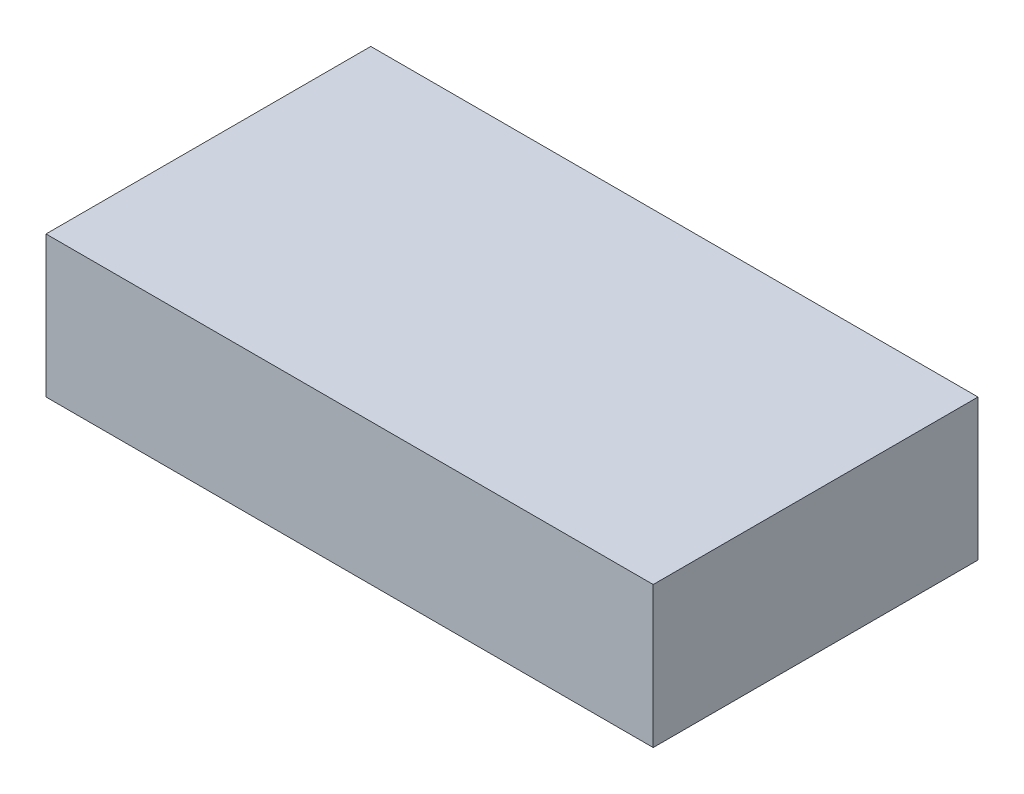
ISO-10303-21;
HEADER;
FILE_DESCRIPTION(('STEP AP214'),'2;1');
FILE_NAME('part.step','',(''),(''),'','','');
FILE_SCHEMA(('AUTOMOTIVE_DESIGN { 1 0 10303 214 1 1 1 1 }'));
ENDSEC;
DATA;
#1=APPLICATION_CONTEXT('core data for automotive mechanical design processes');
#2=APPLICATION_PROTOCOL_DEFINITION('international standard','automotive_design',2000,#1);
#3=PRODUCT_CONTEXT('',#1,'mechanical');
#4=PRODUCT('Part','Part','',(#3));
#5=PRODUCT_RELATED_PRODUCT_CATEGORY('part','',(#4));
#6=PRODUCT_DEFINITION_FORMATION('','',#4);
#7=PRODUCT_DEFINITION_CONTEXT('part definition',#1,'design');
#8=PRODUCT_DEFINITION('design','',#6,#7);
#9=PRODUCT_DEFINITION_SHAPE('','',#8);
#10=(LENGTH_UNIT() NAMED_UNIT(*) SI_UNIT(.MILLI.,.METRE.));
#11=(NAMED_UNIT(*) PLANE_ANGLE_UNIT() SI_UNIT($,.RADIAN.));
#12=(NAMED_UNIT(*) SI_UNIT($,.STERADIAN.) SOLID_ANGLE_UNIT());
#13=UNCERTAINTY_MEASURE_WITH_UNIT(LENGTH_MEASURE(1.E-05),#10,'distance_accuracy_value','');
#14=(GEOMETRIC_REPRESENTATION_CONTEXT(3) GLOBAL_UNCERTAINTY_ASSIGNED_CONTEXT((#13)) GLOBAL_UNIT_ASSIGNED_CONTEXT((#10,
#11,#12)) REPRESENTATION_CONTEXT('',''));
#15=CARTESIAN_POINT('',(0.,0.,0.));
#16=DIRECTION('',(0.,0.,1.));
#17=DIRECTION('',(1.,0.,0.));
#18=AXIS2_PLACEMENT_3D('',#15,#16,#17);
#19=CARTESIAN_POINT('',(107.5,50.,57.5));
#20=DIRECTION('',(-1.,0.,0.));
#21=DIRECTION('',(0.,0.,1.));
#22=AXIS2_PLACEMENT_3D('',#19,#20,#21);
#23=PLANE('',#22);
#24=DIRECTION('',(0.,0.,-1.));
#25=VECTOR('',#24,1.);
#26=CARTESIAN_POINT('',(107.5,0.,57.5));
#27=LINE('',#26,#25);
#28=CARTESIAN_POINT('',(107.5,0.,57.5));
#29=VERTEX_POINT('',#28);
#30=CARTESIAN_POINT('',(107.5,0.,-57.5));
#31=VERTEX_POINT('',#30);
#32=EDGE_CURVE('E96',#29,#31,#27,.T.);
#33=ORIENTED_EDGE('',*,*,#32,.T.);
#34=DIRECTION('',(0.,-1.,0.));
#35=VECTOR('',#34,1.);
#36=CARTESIAN_POINT('',(107.5,50.,-57.5));
#37=LINE('',#36,#35);
#38=CARTESIAN_POINT('',(107.5,50.,-57.5));
#39=VERTEX_POINT('',#38);
#40=EDGE_CURVE('E11',#39,#31,#37,.T.);
#41=ORIENTED_EDGE('',*,*,#40,.F.);
#42=DIRECTION('',(0.,0.,-1.));
#43=VECTOR('',#42,1.);
#44=CARTESIAN_POINT('',(107.5,50.,57.5));
#45=LINE('',#44,#43);
#46=CARTESIAN_POINT('',(107.5,50.,57.5));
#47=VERTEX_POINT('',#46);
#48=EDGE_CURVE('E84',#47,#39,#45,.T.);
#49=ORIENTED_EDGE('',*,*,#48,.F.);
#50=DIRECTION('',(0.,-1.,0.));
#51=VECTOR('',#50,1.);
#52=CARTESIAN_POINT('',(107.5,50.,57.5));
#53=LINE('',#52,#51);
#54=EDGE_CURVE('E92',#47,#29,#53,.T.);
#55=ORIENTED_EDGE('',*,*,#54,.T.);
#56=EDGE_LOOP('',(#33,#41,#49,#55));
#57=FACE_BOUND('',#56,.T.);
#58=ADVANCED_FACE('F33',(#57),#23,.F.);
#59=CARTESIAN_POINT('',(-107.5,50.,-57.5));
#60=DIRECTION('',(0.,0.,1.));
#61=DIRECTION('',(1.,0.,0.));
#62=AXIS2_PLACEMENT_3D('',#59,#60,#61);
#63=PLANE('',#62);
#64=DIRECTION('',(-1.,0.,0.));
#65=VECTOR('',#64,1.);
#66=CARTESIAN_POINT('',(-107.5,0.,-57.5));
#67=LINE('',#66,#65);
#68=CARTESIAN_POINT('',(-107.5,0.,-57.5));
#69=VERTEX_POINT('',#68);
#70=EDGE_CURVE('E88',#31,#69,#67,.T.);
#71=ORIENTED_EDGE('',*,*,#70,.T.);
#72=DIRECTION('',(0.,-1.,0.));
#73=VECTOR('',#72,1.);
#74=CARTESIAN_POINT('',(-107.5,50.,-57.5));
#75=LINE('',#74,#73);
#76=CARTESIAN_POINT('',(-107.5,50.,-57.5));
#77=VERTEX_POINT('',#76);
#78=EDGE_CURVE('E41',#77,#69,#75,.T.);
#79=ORIENTED_EDGE('',*,*,#78,.F.);
#80=DIRECTION('',(-1.,0.,0.));
#81=VECTOR('',#80,1.);
#82=CARTESIAN_POINT('',(-107.5,50.,-57.5));
#83=LINE('',#82,#81);
#84=EDGE_CURVE('E79',#39,#77,#83,.T.);
#85=ORIENTED_EDGE('',*,*,#84,.F.);
#86=ORIENTED_EDGE('',*,*,#40,.T.);
#87=EDGE_LOOP('',(#71,#79,#85,#86));
#88=FACE_BOUND('',#87,.T.);
#89=ADVANCED_FACE('F87',(#88),#63,.F.);
#90=CARTESIAN_POINT('',(-107.5,50.,57.5));
#91=DIRECTION('',(1.,0.,0.));
#92=DIRECTION('',(0.,0.,-1.));
#93=AXIS2_PLACEMENT_3D('',#90,#91,#92);
#94=PLANE('',#93);
#95=DIRECTION('',(0.,0.,1.));
#96=VECTOR('',#95,1.);
#97=CARTESIAN_POINT('',(-107.5,0.,57.5));
#98=LINE('',#97,#96);
#99=CARTESIAN_POINT('',(-107.5,0.,57.5));
#100=VERTEX_POINT('',#99);
#101=EDGE_CURVE('E66',#69,#100,#98,.T.);
#102=ORIENTED_EDGE('',*,*,#101,.T.);
#103=DIRECTION('',(0.,-1.,0.));
#104=VECTOR('',#103,1.);
#105=CARTESIAN_POINT('',(-107.5,50.,57.5));
#106=LINE('',#105,#104);
#107=CARTESIAN_POINT('',(-107.5,50.,57.5));
#108=VERTEX_POINT('',#107);
#109=EDGE_CURVE('E89',#108,#100,#106,.T.);
#110=ORIENTED_EDGE('',*,*,#109,.F.);
#111=DIRECTION('',(0.,0.,1.));
#112=VECTOR('',#111,1.);
#113=CARTESIAN_POINT('',(-107.5,50.,57.5));
#114=LINE('',#113,#112);
#115=EDGE_CURVE('E82',#77,#108,#114,.T.);
#116=ORIENTED_EDGE('',*,*,#115,.F.);
#117=ORIENTED_EDGE('',*,*,#78,.T.);
#118=EDGE_LOOP('',(#102,#110,#116,#117));
#119=FACE_BOUND('',#118,.T.);
#120=ADVANCED_FACE('F90',(#119),#94,.F.);
#121=CARTESIAN_POINT('',(-107.5,50.,57.5));
#122=DIRECTION('',(0.,0.,-1.));
#123=DIRECTION('',(-1.,0.,0.));
#124=AXIS2_PLACEMENT_3D('',#121,#122,#123);
#125=PLANE('',#124);
#126=DIRECTION('',(1.,0.,0.));
#127=VECTOR('',#126,1.);
#128=CARTESIAN_POINT('',(-107.5,0.,57.5));
#129=LINE('',#128,#127);
#130=EDGE_CURVE('E72',#100,#29,#129,.T.);
#131=ORIENTED_EDGE('',*,*,#130,.T.);
#132=ORIENTED_EDGE('',*,*,#54,.F.);
#133=DIRECTION('',(1.,0.,0.));
#134=VECTOR('',#133,1.);
#135=CARTESIAN_POINT('',(-107.5,50.,57.5));
#136=LINE('',#135,#134);
#137=EDGE_CURVE('E49',#108,#47,#136,.T.);
#138=ORIENTED_EDGE('',*,*,#137,.F.);
#139=ORIENTED_EDGE('',*,*,#109,.T.);
#140=EDGE_LOOP('',(#131,#132,#138,#139));
#141=FACE_BOUND('',#140,.T.);
#142=ADVANCED_FACE('F103',(#141),#125,.F.);
#143=CARTESIAN_POINT('',(0.,50.,0.));
#144=DIRECTION('',(0.,-1.,0.));
#145=DIRECTION('',(0.,0.,-1.));
#146=AXIS2_PLACEMENT_3D('',#143,#144,#145);
#147=PLANE('',#146);
#148=ORIENTED_EDGE('',*,*,#48,.T.);
#149=ORIENTED_EDGE('',*,*,#84,.T.);
#150=ORIENTED_EDGE('',*,*,#115,.T.);
#151=ORIENTED_EDGE('',*,*,#137,.T.);
#152=EDGE_LOOP('',(#148,#149,#150,#151));
#153=FACE_BOUND('',#152,.T.);
#154=ADVANCED_FACE('F80',(#153),#147,.F.);
#155=CARTESIAN_POINT('',(0.,0.,0.));
#156=DIRECTION('',(0.,-1.,0.));
#157=DIRECTION('',(0.,0.,-1.));
#158=AXIS2_PLACEMENT_3D('',#155,#156,#157);
#159=PLANE('',#158);
#160=ORIENTED_EDGE('',*,*,#32,.F.);
#161=ORIENTED_EDGE('',*,*,#130,.F.);
#162=ORIENTED_EDGE('',*,*,#101,.F.);
#163=ORIENTED_EDGE('',*,*,#70,.F.);
#164=EDGE_LOOP('',(#160,#161,#162,#163));
#165=FACE_BOUND('',#164,.T.);
#166=ADVANCED_FACE('F106',(#165),#159,.T.);
#167=CLOSED_SHELL('',(#58,#89,#120,#142,#154,#166));
#168=MANIFOLD_SOLID_BREP('B2',#167);
#169=ADVANCED_BREP_SHAPE_REPRESENTATION('',(#18,#168),#14);
#170=SHAPE_DEFINITION_REPRESENTATION(#9,#169);
ENDSEC;
END-ISO-10303-21;
